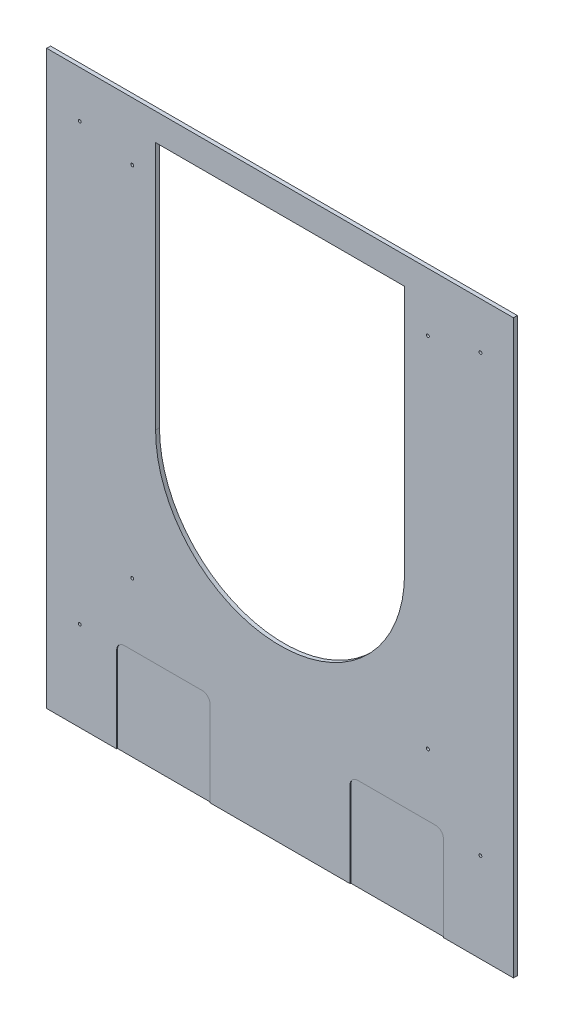
ISO-10303-21;
HEADER;
FILE_DESCRIPTION(('STEP AP214'),'2;1');
FILE_NAME('part.step','',(''),(''),'','','');
FILE_SCHEMA(('AUTOMOTIVE_DESIGN { 1 0 10303 214 1 1 1 1 }'));
ENDSEC;
DATA;
#1=APPLICATION_CONTEXT('core data for automotive mechanical design processes');
#2=APPLICATION_PROTOCOL_DEFINITION('international standard','automotive_design',2000,#1);
#3=PRODUCT_CONTEXT('',#1,'mechanical');
#4=PRODUCT('Part','Part','',(#3));
#5=PRODUCT_RELATED_PRODUCT_CATEGORY('part','',(#4));
#6=PRODUCT_DEFINITION_FORMATION('','',#4);
#7=PRODUCT_DEFINITION_CONTEXT('part definition',#1,'design');
#8=PRODUCT_DEFINITION('design','',#6,#7);
#9=PRODUCT_DEFINITION_SHAPE('','',#8);
#10=(LENGTH_UNIT() NAMED_UNIT(*) SI_UNIT(.MILLI.,.METRE.));
#11=(NAMED_UNIT(*) PLANE_ANGLE_UNIT() SI_UNIT($,.RADIAN.));
#12=(NAMED_UNIT(*) SI_UNIT($,.STERADIAN.) SOLID_ANGLE_UNIT());
#13=UNCERTAINTY_MEASURE_WITH_UNIT(LENGTH_MEASURE(1.E-05),#10,'distance_accuracy_value','');
#14=(GEOMETRIC_REPRESENTATION_CONTEXT(3) GLOBAL_UNCERTAINTY_ASSIGNED_CONTEXT((#13)) GLOBAL_UNIT_ASSIGNED_CONTEXT((#10,
#11,#12)) REPRESENTATION_CONTEXT('',''));
#15=CARTESIAN_POINT('',(0.,0.,0.));
#16=DIRECTION('',(0.,0.,1.));
#17=DIRECTION('',(1.,0.,0.));
#18=AXIS2_PLACEMENT_3D('',#15,#16,#17);
#19=CARTESIAN_POINT('',(-266.7,-327.025,6.35));
#20=DIRECTION('',(-1.,0.,0.));
#21=DIRECTION('',(0.,0.,1.));
#22=AXIS2_PLACEMENT_3D('',#19,#20,#21);
#23=PLANE('',#22);
#24=DIRECTION('',(0.,1.,0.));
#25=VECTOR('',#24,1.);
#26=CARTESIAN_POINT('',(-266.7,0.,5.08));
#27=LINE('',#26,#25);
#28=CARTESIAN_POINT('',(-266.7,-327.025,5.08));
#29=VERTEX_POINT('',#28);
#30=CARTESIAN_POINT('',(-266.7,-466.725,5.08));
#31=VERTEX_POINT('',#30);
#32=EDGE_CURVE('E128',#29,#31,#27,.F.);
#33=ORIENTED_EDGE('',*,*,#32,.F.);
#34=DIRECTION('',(0.,0.,1.));
#35=VECTOR('',#34,1.);
#36=CARTESIAN_POINT('',(-266.7,-327.025,6.35));
#37=LINE('',#36,#35);
#38=CARTESIAN_POINT('',(-266.7,-327.025,6.35));
#39=VERTEX_POINT('',#38);
#40=EDGE_CURVE('E178',#29,#39,#37,.T.);
#41=ORIENTED_EDGE('',*,*,#40,.T.);
#42=DIRECTION('',(0.,1.,0.));
#43=VECTOR('',#42,1.);
#44=CARTESIAN_POINT('',(-266.7,0.,6.35));
#45=LINE('',#44,#43);
#46=CARTESIAN_POINT('',(-266.7,-466.725,6.35));
#47=VERTEX_POINT('',#46);
#48=EDGE_CURVE('E264',#47,#39,#45,.T.);
#49=ORIENTED_EDGE('',*,*,#48,.F.);
#50=DIRECTION('',(0.,0.,1.));
#51=VECTOR('',#50,1.);
#52=CARTESIAN_POINT('',(-266.7,-466.725,6.35));
#53=LINE('',#52,#51);
#54=EDGE_CURVE('E181',#31,#47,#53,.T.);
#55=ORIENTED_EDGE('',*,*,#54,.F.);
#56=EDGE_LOOP('',(#33,#41,#49,#55));
#57=FACE_BOUND('',#56,.T.);
#58=ADVANCED_FACE('F17',(#57),#23,.F.);
#59=CARTESIAN_POINT('',(-254.,-327.025,6.35));
#60=DIRECTION('',(0.,0.,1.));
#61=DIRECTION('',(1.,0.,0.));
#62=AXIS2_PLACEMENT_3D('',#59,#60,#61);
#63=CYLINDRICAL_SURFACE('',#62,12.7);
#64=CARTESIAN_POINT('',(-254.,-327.025,5.08));
#65=DIRECTION('',(0.,0.,1.));
#66=DIRECTION('',(1.,0.,0.));
#67=AXIS2_PLACEMENT_3D('',#64,#65,#66);
#68=CIRCLE('',#67,12.7);
#69=CARTESIAN_POINT('',(-254.,-314.325,5.08));
#70=VERTEX_POINT('',#69);
#71=EDGE_CURVE('E126',#70,#29,#68,.T.);
#72=ORIENTED_EDGE('',*,*,#71,.F.);
#73=DIRECTION('',(0.,0.,1.));
#74=VECTOR('',#73,1.);
#75=CARTESIAN_POINT('',(-254.,-314.325,6.35));
#76=LINE('',#75,#74);
#77=CARTESIAN_POINT('',(-254.,-314.325,6.35));
#78=VERTEX_POINT('',#77);
#79=EDGE_CURVE('E113',#70,#78,#76,.T.);
#80=ORIENTED_EDGE('',*,*,#79,.T.);
#81=CARTESIAN_POINT('',(-254.,-327.025,6.35));
#82=DIRECTION('',(0.,0.,1.));
#83=DIRECTION('',(1.,0.,0.));
#84=AXIS2_PLACEMENT_3D('',#81,#82,#83);
#85=CIRCLE('',#84,12.7);
#86=EDGE_CURVE('E262',#39,#78,#85,.F.);
#87=ORIENTED_EDGE('',*,*,#86,.F.);
#88=ORIENTED_EDGE('',*,*,#40,.F.);
#89=EDGE_LOOP('',(#72,#80,#87,#88));
#90=FACE_BOUND('',#89,.T.);
#91=ADVANCED_FACE('F540',(#90),#63,.F.);
#92=CARTESIAN_POINT('',(-127.,-314.325,6.35));
#93=DIRECTION('',(0.,1.,0.));
#94=DIRECTION('',(0.,0.,1.));
#95=AXIS2_PLACEMENT_3D('',#92,#93,#94);
#96=PLANE('',#95);
#97=DIRECTION('',(1.,0.,0.));
#98=VECTOR('',#97,1.);
#99=CARTESIAN_POINT('',(0.,-314.325,5.08));
#100=LINE('',#99,#98);
#101=CARTESIAN_POINT('',(-127.,-314.325,5.08));
#102=VERTEX_POINT('',#101);
#103=EDGE_CURVE('E120',#102,#70,#100,.F.);
#104=ORIENTED_EDGE('',*,*,#103,.F.);
#105=DIRECTION('',(0.,0.,1.));
#106=VECTOR('',#105,1.);
#107=CARTESIAN_POINT('',(-127.,-314.325,6.35));
#108=LINE('',#107,#106);
#109=CARTESIAN_POINT('',(-127.,-314.325,6.35));
#110=VERTEX_POINT('',#109);
#111=EDGE_CURVE('E105',#102,#110,#108,.T.);
#112=ORIENTED_EDGE('',*,*,#111,.T.);
#113=DIRECTION('',(1.,0.,0.));
#114=VECTOR('',#113,1.);
#115=CARTESIAN_POINT('',(0.,-314.325,6.35));
#116=LINE('',#115,#114);
#117=EDGE_CURVE('E261',#78,#110,#116,.T.);
#118=ORIENTED_EDGE('',*,*,#117,.F.);
#119=ORIENTED_EDGE('',*,*,#79,.F.);
#120=EDGE_LOOP('',(#104,#112,#118,#119));
#121=FACE_BOUND('',#120,.T.);
#122=ADVANCED_FACE('F124',(#121),#96,.F.);
#123=CARTESIAN_POINT('',(-127.,-327.025,6.35));
#124=DIRECTION('',(0.,0.,1.));
#125=DIRECTION('',(1.,0.,0.));
#126=AXIS2_PLACEMENT_3D('',#123,#124,#125);
#127=CYLINDRICAL_SURFACE('',#126,12.7);
#128=CARTESIAN_POINT('',(-127.,-327.025,5.08));
#129=DIRECTION('',(0.,0.,1.));
#130=DIRECTION('',(1.,0.,0.));
#131=AXIS2_PLACEMENT_3D('',#128,#129,#130);
#132=CIRCLE('',#131,12.7);
#133=CARTESIAN_POINT('',(-114.3,-327.025,5.08));
#134=VERTEX_POINT('',#133);
#135=EDGE_CURVE('E20',#134,#102,#132,.T.);
#136=ORIENTED_EDGE('',*,*,#135,.F.);
#137=DIRECTION('',(0.,0.,-1.));
#138=VECTOR('',#137,1.);
#139=CARTESIAN_POINT('',(-114.3,-327.025,6.35));
#140=LINE('',#139,#138);
#141=CARTESIAN_POINT('',(-114.3,-327.025,6.35));
#142=VERTEX_POINT('',#141);
#143=EDGE_CURVE('E98',#134,#142,#140,.F.);
#144=ORIENTED_EDGE('',*,*,#143,.T.);
#145=CARTESIAN_POINT('',(-127.,-327.025,6.35));
#146=DIRECTION('',(0.,0.,1.));
#147=DIRECTION('',(1.,0.,0.));
#148=AXIS2_PLACEMENT_3D('',#145,#146,#147);
#149=CIRCLE('',#148,12.7);
#150=EDGE_CURVE('E108',#110,#142,#149,.F.);
#151=ORIENTED_EDGE('',*,*,#150,.F.);
#152=ORIENTED_EDGE('',*,*,#111,.F.);
#153=EDGE_LOOP('',(#136,#144,#151,#152));
#154=FACE_BOUND('',#153,.T.);
#155=ADVANCED_FACE('F107',(#154),#127,.F.);
#156=CARTESIAN_POINT('',(-114.3,-466.725,6.35));
#157=DIRECTION('',(1.,0.,0.));
#158=DIRECTION('',(0.,0.,-1.));
#159=AXIS2_PLACEMENT_3D('',#156,#157,#158);
#160=PLANE('',#159);
#161=DIRECTION('',(0.,1.,0.));
#162=VECTOR('',#161,1.);
#163=CARTESIAN_POINT('',(-114.3,0.,5.08));
#164=LINE('',#163,#162);
#165=CARTESIAN_POINT('',(-114.3,-466.725,5.08));
#166=VERTEX_POINT('',#165);
#167=EDGE_CURVE('E123',#166,#134,#164,.T.);
#168=ORIENTED_EDGE('',*,*,#167,.F.);
#169=DIRECTION('',(0.,0.,-1.));
#170=VECTOR('',#169,1.);
#171=CARTESIAN_POINT('',(-114.3,-466.725,6.35));
#172=LINE('',#171,#170);
#173=CARTESIAN_POINT('',(-114.3,-466.725,6.35));
#174=VERTEX_POINT('',#173);
#175=EDGE_CURVE('E112',#174,#166,#172,.T.);
#176=ORIENTED_EDGE('',*,*,#175,.F.);
#177=DIRECTION('',(0.,1.,0.));
#178=VECTOR('',#177,1.);
#179=CARTESIAN_POINT('',(-114.3,0.,6.35));
#180=LINE('',#179,#178);
#181=EDGE_CURVE('E260',#142,#174,#180,.F.);
#182=ORIENTED_EDGE('',*,*,#181,.F.);
#183=ORIENTED_EDGE('',*,*,#143,.F.);
#184=EDGE_LOOP('',(#168,#176,#182,#183));
#185=FACE_BOUND('',#184,.T.);
#186=ADVANCED_FACE('F430',(#185),#160,.F.);
#187=CARTESIAN_POINT('',(114.3,-327.025,6.35));
#188=DIRECTION('',(-1.,0.,0.));
#189=DIRECTION('',(0.,0.,1.));
#190=AXIS2_PLACEMENT_3D('',#187,#188,#189);
#191=PLANE('',#190);
#192=DIRECTION('',(0.,1.,0.));
#193=VECTOR('',#192,1.);
#194=CARTESIAN_POINT('',(114.3,0.,5.08));
#195=LINE('',#194,#193);
#196=CARTESIAN_POINT('',(114.3,-327.025,5.08));
#197=VERTEX_POINT('',#196);
#198=CARTESIAN_POINT('',(114.3,-466.725,5.08));
#199=VERTEX_POINT('',#198);
#200=EDGE_CURVE('E268',#197,#199,#195,.F.);
#201=ORIENTED_EDGE('',*,*,#200,.F.);
#202=DIRECTION('',(0.,0.,1.));
#203=VECTOR('',#202,1.);
#204=CARTESIAN_POINT('',(114.3,-327.025,6.35));
#205=LINE('',#204,#203);
#206=CARTESIAN_POINT('',(114.3,-327.025,6.35));
#207=VERTEX_POINT('',#206);
#208=EDGE_CURVE('E157',#197,#207,#205,.T.);
#209=ORIENTED_EDGE('',*,*,#208,.T.);
#210=DIRECTION('',(0.,1.,0.));
#211=VECTOR('',#210,1.);
#212=CARTESIAN_POINT('',(114.3,0.,6.35));
#213=LINE('',#212,#211);
#214=CARTESIAN_POINT('',(114.3,-466.725,6.35));
#215=VERTEX_POINT('',#214);
#216=EDGE_CURVE('E258',#215,#207,#213,.T.);
#217=ORIENTED_EDGE('',*,*,#216,.F.);
#218=DIRECTION('',(0.,0.,1.));
#219=VECTOR('',#218,1.);
#220=CARTESIAN_POINT('',(114.3,-466.725,6.35));
#221=LINE('',#220,#219);
#222=EDGE_CURVE('E160',#199,#215,#221,.T.);
#223=ORIENTED_EDGE('',*,*,#222,.F.);
#224=EDGE_LOOP('',(#201,#209,#217,#223));
#225=FACE_BOUND('',#224,.T.);
#226=ADVANCED_FACE('F432',(#225),#191,.F.);
#227=CARTESIAN_POINT('',(127.,-327.025,6.35));
#228=DIRECTION('',(0.,0.,1.));
#229=DIRECTION('',(1.,0.,0.));
#230=AXIS2_PLACEMENT_3D('',#227,#228,#229);
#231=CYLINDRICAL_SURFACE('',#230,12.7);
#232=CARTESIAN_POINT('',(127.,-327.025,5.08));
#233=DIRECTION('',(0.,0.,1.));
#234=DIRECTION('',(1.,0.,0.));
#235=AXIS2_PLACEMENT_3D('',#232,#233,#234);
#236=CIRCLE('',#235,12.7);
#237=CARTESIAN_POINT('',(127.,-314.325,5.08));
#238=VERTEX_POINT('',#237);
#239=EDGE_CURVE('E265',#238,#197,#236,.T.);
#240=ORIENTED_EDGE('',*,*,#239,.F.);
#241=DIRECTION('',(0.,0.,1.));
#242=VECTOR('',#241,1.);
#243=CARTESIAN_POINT('',(127.,-314.325,6.35));
#244=LINE('',#243,#242);
#245=CARTESIAN_POINT('',(127.,-314.325,6.35));
#246=VERTEX_POINT('',#245);
#247=EDGE_CURVE('E154',#238,#246,#244,.T.);
#248=ORIENTED_EDGE('',*,*,#247,.T.);
#249=CARTESIAN_POINT('',(127.,-327.025,6.35));
#250=DIRECTION('',(0.,0.,1.));
#251=DIRECTION('',(1.,0.,0.));
#252=AXIS2_PLACEMENT_3D('',#249,#250,#251);
#253=CIRCLE('',#252,12.7);
#254=EDGE_CURVE('E256',#207,#246,#253,.F.);
#255=ORIENTED_EDGE('',*,*,#254,.F.);
#256=ORIENTED_EDGE('',*,*,#208,.F.);
#257=EDGE_LOOP('',(#240,#248,#255,#256));
#258=FACE_BOUND('',#257,.T.);
#259=ADVANCED_FACE('F439',(#258),#231,.F.);
#260=CARTESIAN_POINT('',(254.,-314.325,6.35));
#261=DIRECTION('',(0.,1.,0.));
#262=DIRECTION('',(0.,0.,1.));
#263=AXIS2_PLACEMENT_3D('',#260,#261,#262);
#264=PLANE('',#263);
#265=DIRECTION('',(1.,0.,0.));
#266=VECTOR('',#265,1.);
#267=CARTESIAN_POINT('',(0.,-314.325,5.08));
#268=LINE('',#267,#266);
#269=CARTESIAN_POINT('',(254.,-314.325,5.08));
#270=VERTEX_POINT('',#269);
#271=EDGE_CURVE('E269',#270,#238,#268,.F.);
#272=ORIENTED_EDGE('',*,*,#271,.F.);
#273=DIRECTION('',(0.,0.,1.));
#274=VECTOR('',#273,1.);
#275=CARTESIAN_POINT('',(254.,-314.325,6.35));
#276=LINE('',#275,#274);
#277=CARTESIAN_POINT('',(254.,-314.325,6.35));
#278=VERTEX_POINT('',#277);
#279=EDGE_CURVE('E142',#270,#278,#276,.T.);
#280=ORIENTED_EDGE('',*,*,#279,.T.);
#281=DIRECTION('',(1.,0.,0.));
#282=VECTOR('',#281,1.);
#283=CARTESIAN_POINT('',(0.,-314.325,6.35));
#284=LINE('',#283,#282);
#285=EDGE_CURVE('E255',#246,#278,#284,.T.);
#286=ORIENTED_EDGE('',*,*,#285,.F.);
#287=ORIENTED_EDGE('',*,*,#247,.F.);
#288=EDGE_LOOP('',(#272,#280,#286,#287));
#289=FACE_BOUND('',#288,.T.);
#290=ADVANCED_FACE('F520',(#289),#264,.F.);
#291=CARTESIAN_POINT('',(254.,-327.025,6.35));
#292=DIRECTION('',(0.,0.,1.));
#293=DIRECTION('',(1.,0.,0.));
#294=AXIS2_PLACEMENT_3D('',#291,#292,#293);
#295=CYLINDRICAL_SURFACE('',#294,12.7);
#296=CARTESIAN_POINT('',(254.,-327.025,5.08));
#297=DIRECTION('',(0.,0.,1.));
#298=DIRECTION('',(1.,0.,0.));
#299=AXIS2_PLACEMENT_3D('',#296,#297,#298);
#300=CIRCLE('',#299,12.7);
#301=CARTESIAN_POINT('',(266.7,-327.025,5.08));
#302=VERTEX_POINT('',#301);
#303=EDGE_CURVE('E270',#302,#270,#300,.T.);
#304=ORIENTED_EDGE('',*,*,#303,.F.);
#305=DIRECTION('',(0.,0.,-1.));
#306=VECTOR('',#305,1.);
#307=CARTESIAN_POINT('',(266.7,-327.025,6.35));
#308=LINE('',#307,#306);
#309=CARTESIAN_POINT('',(266.7,-327.025,6.35));
#310=VERTEX_POINT('',#309);
#311=EDGE_CURVE('E134',#302,#310,#308,.F.);
#312=ORIENTED_EDGE('',*,*,#311,.T.);
#313=CARTESIAN_POINT('',(254.,-327.025,6.35));
#314=DIRECTION('',(0.,0.,1.));
#315=DIRECTION('',(1.,0.,0.));
#316=AXIS2_PLACEMENT_3D('',#313,#314,#315);
#317=CIRCLE('',#316,12.7);
#318=EDGE_CURVE('E253',#278,#310,#317,.F.);
#319=ORIENTED_EDGE('',*,*,#318,.F.);
#320=ORIENTED_EDGE('',*,*,#279,.F.);
#321=EDGE_LOOP('',(#304,#312,#319,#320));
#322=FACE_BOUND('',#321,.T.);
#323=ADVANCED_FACE('F516',(#322),#295,.F.);
#324=CARTESIAN_POINT('',(266.7,-466.725,6.35));
#325=DIRECTION('',(1.,0.,0.));
#326=DIRECTION('',(0.,0.,-1.));
#327=AXIS2_PLACEMENT_3D('',#324,#325,#326);
#328=PLANE('',#327);
#329=DIRECTION('',(0.,1.,0.));
#330=VECTOR('',#329,1.);
#331=CARTESIAN_POINT('',(266.7,0.,5.08));
#332=LINE('',#331,#330);
#333=CARTESIAN_POINT('',(266.7,-466.725,5.08));
#334=VERTEX_POINT('',#333);
#335=EDGE_CURVE('E272',#334,#302,#332,.T.);
#336=ORIENTED_EDGE('',*,*,#335,.F.);
#337=DIRECTION('',(0.,0.,-1.));
#338=VECTOR('',#337,1.);
#339=CARTESIAN_POINT('',(266.7,-466.725,6.35));
#340=LINE('',#339,#338);
#341=CARTESIAN_POINT('',(266.7,-466.725,6.35));
#342=VERTEX_POINT('',#341);
#343=EDGE_CURVE('E139',#342,#334,#340,.T.);
#344=ORIENTED_EDGE('',*,*,#343,.F.);
#345=DIRECTION('',(0.,1.,0.));
#346=VECTOR('',#345,1.);
#347=CARTESIAN_POINT('',(266.7,0.,6.35));
#348=LINE('',#347,#346);
#349=EDGE_CURVE('E169',#310,#342,#348,.F.);
#350=ORIENTED_EDGE('',*,*,#349,.F.);
#351=ORIENTED_EDGE('',*,*,#311,.F.);
#352=EDGE_LOOP('',(#336,#344,#350,#351));
#353=FACE_BOUND('',#352,.T.);
#354=ADVANCED_FACE('F513',(#353),#328,.F.);
#355=CARTESIAN_POINT('',(0.,0.,5.08));
#356=DIRECTION('',(0.,0.,1.));
#357=DIRECTION('',(1.,0.,0.));
#358=AXIS2_PLACEMENT_3D('',#355,#356,#357);
#359=PLANE('',#358);
#360=ORIENTED_EDGE('',*,*,#32,.T.);
#361=DIRECTION('',(1.,0.,0.));
#362=VECTOR('',#361,1.);
#363=CARTESIAN_POINT('',(-381.,-466.725,5.08));
#364=LINE('',#363,#362);
#365=EDGE_CURVE('E168',#166,#31,#364,.F.);
#366=ORIENTED_EDGE('',*,*,#365,.F.);
#367=ORIENTED_EDGE('',*,*,#167,.T.);
#368=ORIENTED_EDGE('',*,*,#135,.T.);
#369=ORIENTED_EDGE('',*,*,#103,.T.);
#370=ORIENTED_EDGE('',*,*,#71,.T.);
#371=EDGE_LOOP('',(#360,#366,#367,#368,#369,#370));
#372=FACE_BOUND('',#371,.T.);
#373=ADVANCED_FACE('F118',(#372),#359,.T.);
#374=CARTESIAN_POINT('',(0.,0.,5.08));
#375=DIRECTION('',(0.,0.,1.));
#376=DIRECTION('',(1.,0.,0.));
#377=AXIS2_PLACEMENT_3D('',#374,#375,#376);
#378=PLANE('',#377);
#379=ORIENTED_EDGE('',*,*,#200,.T.);
#380=DIRECTION('',(1.,0.,0.));
#381=VECTOR('',#380,1.);
#382=CARTESIAN_POINT('',(-381.,-466.725,5.08));
#383=LINE('',#382,#381);
#384=EDGE_CURVE('E148',#334,#199,#383,.F.);
#385=ORIENTED_EDGE('',*,*,#384,.F.);
#386=ORIENTED_EDGE('',*,*,#335,.T.);
#387=ORIENTED_EDGE('',*,*,#303,.T.);
#388=ORIENTED_EDGE('',*,*,#271,.T.);
#389=ORIENTED_EDGE('',*,*,#239,.T.);
#390=EDGE_LOOP('',(#379,#385,#386,#387,#388,#389));
#391=FACE_BOUND('',#390,.T.);
#392=ADVANCED_FACE('F507',(#391),#378,.T.);
#393=CARTESIAN_POINT('',(0.,0.,6.35));
#394=DIRECTION('',(0.,0.,1.));
#395=DIRECTION('',(1.,0.,0.));
#396=AXIS2_PLACEMENT_3D('',#393,#394,#395);
#397=PLANE('',#396);
#398=CARTESIAN_POINT('',(-327.025,390.525,6.35));
#399=DIRECTION('',(0.,0.,1.));
#400=DIRECTION('',(1.,0.,0.));
#401=AXIS2_PLACEMENT_3D('',#398,#399,#400);
#402=CIRCLE('',#401,2.413);
#403=CARTESIAN_POINT('',(-324.612,390.525,6.35));
#404=VERTEX_POINT('',#403);
#405=EDGE_CURVE('E224',#404,#404,#402,.F.);
#406=ORIENTED_EDGE('',*,*,#405,.T.);
#407=EDGE_LOOP('',(#406));
#408=FACE_BOUND('',#407,.T.);
#409=CARTESIAN_POINT('',(-327.025,-320.675,6.35));
#410=DIRECTION('',(0.,0.,1.));
#411=DIRECTION('',(1.,0.,0.));
#412=AXIS2_PLACEMENT_3D('',#409,#410,#411);
#413=CIRCLE('',#412,2.413);
#414=CARTESIAN_POINT('',(-324.612,-320.675,6.35));
#415=VERTEX_POINT('',#414);
#416=EDGE_CURVE('E228',#415,#415,#413,.F.);
#417=ORIENTED_EDGE('',*,*,#416,.T.);
#418=EDGE_LOOP('',(#417));
#419=FACE_BOUND('',#418,.T.);
#420=CARTESIAN_POINT('',(327.025,-320.675,6.35));
#421=DIRECTION('',(0.,0.,1.));
#422=DIRECTION('',(1.,0.,0.));
#423=AXIS2_PLACEMENT_3D('',#420,#421,#422);
#424=CIRCLE('',#423,2.413);
#425=CARTESIAN_POINT('',(329.438,-320.675,6.35));
#426=VERTEX_POINT('',#425);
#427=EDGE_CURVE('E231',#426,#426,#424,.F.);
#428=ORIENTED_EDGE('',*,*,#427,.T.);
#429=EDGE_LOOP('',(#428));
#430=FACE_BOUND('',#429,.T.);
#431=CARTESIAN_POINT('',(327.025,390.525,6.35));
#432=DIRECTION('',(0.,0.,1.));
#433=DIRECTION('',(1.,0.,0.));
#434=AXIS2_PLACEMENT_3D('',#431,#432,#433);
#435=CIRCLE('',#434,2.413);
#436=CARTESIAN_POINT('',(329.438,390.525,6.35));
#437=VERTEX_POINT('',#436);
#438=EDGE_CURVE('E234',#437,#437,#435,.F.);
#439=ORIENTED_EDGE('',*,*,#438,.T.);
#440=EDGE_LOOP('',(#439));
#441=FACE_BOUND('',#440,.T.);
#442=CARTESIAN_POINT('',(-241.3,371.475,6.35));
#443=DIRECTION('',(0.,0.,1.));
#444=DIRECTION('',(1.,0.,0.));
#445=AXIS2_PLACEMENT_3D('',#442,#443,#444);
#446=CIRCLE('',#445,2.413);
#447=CARTESIAN_POINT('',(-238.887,371.475,6.35));
#448=VERTEX_POINT('',#447);
#449=EDGE_CURVE('E237',#448,#448,#446,.F.);
#450=ORIENTED_EDGE('',*,*,#449,.T.);
#451=EDGE_LOOP('',(#450));
#452=FACE_BOUND('',#451,.T.);
#453=CARTESIAN_POINT('',(-241.3,-212.725,6.35));
#454=DIRECTION('',(0.,0.,1.));
#455=DIRECTION('',(1.,0.,0.));
#456=AXIS2_PLACEMENT_3D('',#453,#454,#455);
#457=CIRCLE('',#456,2.413);
#458=CARTESIAN_POINT('',(-238.887,-212.725,6.35));
#459=VERTEX_POINT('',#458);
#460=EDGE_CURVE('E240',#459,#459,#457,.F.);
#461=ORIENTED_EDGE('',*,*,#460,.T.);
#462=EDGE_LOOP('',(#461));
#463=FACE_BOUND('',#462,.T.);
#464=CARTESIAN_POINT('',(241.3,-212.725,6.35));
#465=DIRECTION('',(0.,0.,1.));
#466=DIRECTION('',(1.,0.,0.));
#467=AXIS2_PLACEMENT_3D('',#464,#465,#466);
#468=CIRCLE('',#467,2.413);
#469=CARTESIAN_POINT('',(243.713,-212.725,6.35));
#470=VERTEX_POINT('',#469);
#471=EDGE_CURVE('E243',#470,#470,#468,.F.);
#472=ORIENTED_EDGE('',*,*,#471,.T.);
#473=EDGE_LOOP('',(#472));
#474=FACE_BOUND('',#473,.T.);
#475=CARTESIAN_POINT('',(241.3,371.475,6.35));
#476=DIRECTION('',(0.,0.,1.));
#477=DIRECTION('',(1.,0.,0.));
#478=AXIS2_PLACEMENT_3D('',#475,#476,#477);
#479=CIRCLE('',#478,2.413);
#480=CARTESIAN_POINT('',(243.713,371.475,6.35));
#481=VERTEX_POINT('',#480);
#482=EDGE_CURVE('E246',#481,#481,#479,.F.);
#483=ORIENTED_EDGE('',*,*,#482,.T.);
#484=EDGE_LOOP('',(#483));
#485=FACE_BOUND('',#484,.T.);
#486=DIRECTION('',(0.,1.,0.));
#487=VECTOR('',#486,1.);
#488=CARTESIAN_POINT('',(-203.2,422.275,6.35));
#489=LINE('',#488,#487);
#490=CARTESIAN_POINT('',(-203.2,15.875,6.35));
#491=VERTEX_POINT('',#490);
#492=CARTESIAN_POINT('',(-203.2,422.275,6.35));
#493=VERTEX_POINT('',#492);
#494=EDGE_CURVE('E296',#491,#493,#489,.T.);
#495=ORIENTED_EDGE('',*,*,#494,.T.);
#496=DIRECTION('',(1.,0.,0.));
#497=VECTOR('',#496,1.);
#498=CARTESIAN_POINT('',(203.2,422.275,6.35));
#499=LINE('',#498,#497);
#500=CARTESIAN_POINT('',(203.2,422.275,6.35));
#501=VERTEX_POINT('',#500);
#502=EDGE_CURVE('E301',#493,#501,#499,.T.);
#503=ORIENTED_EDGE('',*,*,#502,.T.);
#504=DIRECTION('',(0.,1.,0.));
#505=VECTOR('',#504,1.);
#506=CARTESIAN_POINT('',(203.2,15.875,6.35));
#507=LINE('',#506,#505);
#508=CARTESIAN_POINT('',(203.2,15.875,6.35));
#509=VERTEX_POINT('',#508);
#510=EDGE_CURVE('E291',#501,#509,#507,.F.);
#511=ORIENTED_EDGE('',*,*,#510,.T.);
#512=CARTESIAN_POINT('',(0.,15.875,6.35));
#513=DIRECTION('',(0.,0.,1.));
#514=DIRECTION('',(1.,0.,0.));
#515=AXIS2_PLACEMENT_3D('',#512,#513,#514);
#516=CIRCLE('',#515,203.2);
#517=EDGE_CURVE('E250',#509,#491,#516,.F.);
#518=ORIENTED_EDGE('',*,*,#517,.T.);
#519=EDGE_LOOP('',(#495,#503,#511,#518));
#520=FACE_BOUND('',#519,.T.);
#521=ORIENTED_EDGE('',*,*,#318,.T.);
#522=ORIENTED_EDGE('',*,*,#349,.T.);
#523=DIRECTION('',(1.,0.,0.));
#524=VECTOR('',#523,1.);
#525=CARTESIAN_POINT('',(-381.,-466.725,6.35));
#526=LINE('',#525,#524);
#527=CARTESIAN_POINT('',(381.,-466.725,6.35));
#528=VERTEX_POINT('',#527);
#529=EDGE_CURVE('E145',#528,#342,#526,.F.);
#530=ORIENTED_EDGE('',*,*,#529,.F.);
#531=DIRECTION('',(0.,1.,0.));
#532=VECTOR('',#531,1.);
#533=CARTESIAN_POINT('',(381.,-466.725,6.35));
#534=LINE('',#533,#532);
#535=CARTESIAN_POINT('',(381.,466.725,6.35));
#536=VERTEX_POINT('',#535);
#537=EDGE_CURVE('E192',#536,#528,#534,.F.);
#538=ORIENTED_EDGE('',*,*,#537,.F.);
#539=DIRECTION('',(1.,0.,0.));
#540=VECTOR('',#539,1.);
#541=CARTESIAN_POINT('',(381.,466.725,6.35));
#542=LINE('',#541,#540);
#543=CARTESIAN_POINT('',(-381.,466.725,6.35));
#544=VERTEX_POINT('',#543);
#545=EDGE_CURVE('E326',#544,#536,#542,.T.);
#546=ORIENTED_EDGE('',*,*,#545,.F.);
#547=DIRECTION('',(0.,1.,0.));
#548=VECTOR('',#547,1.);
#549=CARTESIAN_POINT('',(-381.,466.725,6.35));
#550=LINE('',#549,#548);
#551=CARTESIAN_POINT('',(-381.,-466.725,6.35));
#552=VERTEX_POINT('',#551);
#553=EDGE_CURVE('E335',#552,#544,#550,.T.);
#554=ORIENTED_EDGE('',*,*,#553,.F.);
#555=DIRECTION('',(1.,0.,0.));
#556=VECTOR('',#555,1.);
#557=CARTESIAN_POINT('',(-381.,-466.725,6.35));
#558=LINE('',#557,#556);
#559=EDGE_CURVE('E149',#47,#552,#558,.F.);
#560=ORIENTED_EDGE('',*,*,#559,.F.);
#561=ORIENTED_EDGE('',*,*,#48,.T.);
#562=ORIENTED_EDGE('',*,*,#86,.T.);
#563=ORIENTED_EDGE('',*,*,#117,.T.);
#564=ORIENTED_EDGE('',*,*,#150,.T.);
#565=ORIENTED_EDGE('',*,*,#181,.T.);
#566=DIRECTION('',(1.,0.,0.));
#567=VECTOR('',#566,1.);
#568=CARTESIAN_POINT('',(-381.,-466.725,6.35));
#569=LINE('',#568,#567);
#570=EDGE_CURVE('E165',#215,#174,#569,.F.);
#571=ORIENTED_EDGE('',*,*,#570,.F.);
#572=ORIENTED_EDGE('',*,*,#216,.T.);
#573=ORIENTED_EDGE('',*,*,#254,.T.);
#574=ORIENTED_EDGE('',*,*,#285,.T.);
#575=EDGE_LOOP('',(#521,#522,#530,#538,#546,#554,#560,#561,#562,#563,#564,#565,#571,#572,#573,#574));
#576=FACE_BOUND('',#575,.T.);
#577=ADVANCED_FACE('F398',(#408,#419,#430,#441,#452,#463,#474,#485,#520,#576),#397,.T.);
#578=CARTESIAN_POINT('',(-381.,-466.725,0.));
#579=DIRECTION('',(0.,-1.,0.));
#580=DIRECTION('',(0.,0.,-1.));
#581=AXIS2_PLACEMENT_3D('',#578,#579,#580);
#582=PLANE('',#581);
#583=ORIENTED_EDGE('',*,*,#343,.T.);
#584=ORIENTED_EDGE('',*,*,#384,.T.);
#585=ORIENTED_EDGE('',*,*,#222,.T.);
#586=ORIENTED_EDGE('',*,*,#570,.T.);
#587=ORIENTED_EDGE('',*,*,#175,.T.);
#588=ORIENTED_EDGE('',*,*,#365,.T.);
#589=ORIENTED_EDGE('',*,*,#54,.T.);
#590=ORIENTED_EDGE('',*,*,#559,.T.);
#591=DIRECTION('',(0.,0.,1.));
#592=VECTOR('',#591,1.);
#593=CARTESIAN_POINT('',(-381.,-466.725,0.));
#594=LINE('',#593,#592);
#595=CARTESIAN_POINT('',(-381.,-466.725,0.));
#596=VERTEX_POINT('',#595);
#597=EDGE_CURVE('E332',#596,#552,#594,.T.);
#598=ORIENTED_EDGE('',*,*,#597,.F.);
#599=DIRECTION('',(1.,0.,0.));
#600=VECTOR('',#599,1.);
#601=CARTESIAN_POINT('',(0.,-466.725,0.));
#602=LINE('',#601,#600);
#603=CARTESIAN_POINT('',(381.,-466.725,0.));
#604=VERTEX_POINT('',#603);
#605=EDGE_CURVE('E227',#596,#604,#602,.T.);
#606=ORIENTED_EDGE('',*,*,#605,.T.);
#607=DIRECTION('',(0.,0.,-1.));
#608=VECTOR('',#607,1.);
#609=CARTESIAN_POINT('',(381.,-466.725,0.));
#610=LINE('',#609,#608);
#611=EDGE_CURVE('E323',#528,#604,#610,.T.);
#612=ORIENTED_EDGE('',*,*,#611,.F.);
#613=ORIENTED_EDGE('',*,*,#529,.T.);
#614=EDGE_LOOP('',(#583,#584,#585,#586,#587,#588,#589,#590,#598,#606,#612,#613));
#615=FACE_BOUND('',#614,.T.);
#616=ADVANCED_FACE('F428',(#615),#582,.T.);
#617=CARTESIAN_POINT('',(381.,-466.725,0.));
#618=DIRECTION('',(1.,0.,0.));
#619=DIRECTION('',(0.,0.,-1.));
#620=AXIS2_PLACEMENT_3D('',#617,#618,#619);
#621=PLANE('',#620);
#622=ORIENTED_EDGE('',*,*,#611,.T.);
#623=DIRECTION('',(0.,1.,0.));
#624=VECTOR('',#623,1.);
#625=CARTESIAN_POINT('',(381.,0.,0.));
#626=LINE('',#625,#624);
#627=CARTESIAN_POINT('',(381.,466.725,0.));
#628=VERTEX_POINT('',#627);
#629=EDGE_CURVE('E359',#604,#628,#626,.T.);
#630=ORIENTED_EDGE('',*,*,#629,.T.);
#631=DIRECTION('',(0.,0.,1.));
#632=VECTOR('',#631,1.);
#633=CARTESIAN_POINT('',(381.,466.725,0.));
#634=LINE('',#633,#632);
#635=EDGE_CURVE('E329',#536,#628,#634,.F.);
#636=ORIENTED_EDGE('',*,*,#635,.F.);
#637=ORIENTED_EDGE('',*,*,#537,.T.);
#638=EDGE_LOOP('',(#622,#630,#636,#637));
#639=FACE_BOUND('',#638,.T.);
#640=ADVANCED_FACE('F498',(#639),#621,.T.);
#641=CARTESIAN_POINT('',(381.,466.725,0.));
#642=DIRECTION('',(0.,1.,0.));
#643=DIRECTION('',(0.,0.,1.));
#644=AXIS2_PLACEMENT_3D('',#641,#642,#643);
#645=PLANE('',#644);
#646=ORIENTED_EDGE('',*,*,#635,.T.);
#647=DIRECTION('',(1.,0.,0.));
#648=VECTOR('',#647,1.);
#649=CARTESIAN_POINT('',(0.,466.725,0.));
#650=LINE('',#649,#648);
#651=CARTESIAN_POINT('',(-381.,466.725,0.));
#652=VERTEX_POINT('',#651);
#653=EDGE_CURVE('E362',#628,#652,#650,.F.);
#654=ORIENTED_EDGE('',*,*,#653,.T.);
#655=DIRECTION('',(0.,0.,1.));
#656=VECTOR('',#655,1.);
#657=CARTESIAN_POINT('',(-381.,466.725,0.));
#658=LINE('',#657,#656);
#659=EDGE_CURVE('E304',#544,#652,#658,.F.);
#660=ORIENTED_EDGE('',*,*,#659,.F.);
#661=ORIENTED_EDGE('',*,*,#545,.T.);
#662=EDGE_LOOP('',(#646,#654,#660,#661));
#663=FACE_BOUND('',#662,.T.);
#664=ADVANCED_FACE('F494',(#663),#645,.T.);
#665=CARTESIAN_POINT('',(-381.,466.725,0.));
#666=DIRECTION('',(-1.,0.,0.));
#667=DIRECTION('',(0.,0.,1.));
#668=AXIS2_PLACEMENT_3D('',#665,#666,#667);
#669=PLANE('',#668);
#670=ORIENTED_EDGE('',*,*,#659,.T.);
#671=DIRECTION('',(0.,1.,0.));
#672=VECTOR('',#671,1.);
#673=CARTESIAN_POINT('',(-381.,0.,0.));
#674=LINE('',#673,#672);
#675=EDGE_CURVE('E351',#652,#596,#674,.F.);
#676=ORIENTED_EDGE('',*,*,#675,.T.);
#677=ORIENTED_EDGE('',*,*,#597,.T.);
#678=ORIENTED_EDGE('',*,*,#553,.T.);
#679=EDGE_LOOP('',(#670,#676,#677,#678));
#680=FACE_BOUND('',#679,.T.);
#681=ADVANCED_FACE('F491',(#680),#669,.T.);
#682=CARTESIAN_POINT('',(203.2,422.275,6.35));
#683=DIRECTION('',(0.,1.,0.));
#684=DIRECTION('',(0.,0.,1.));
#685=AXIS2_PLACEMENT_3D('',#682,#683,#684);
#686=PLANE('',#685);
#687=ORIENTED_EDGE('',*,*,#502,.F.);
#688=DIRECTION('',(0.,0.,1.));
#689=VECTOR('',#688,1.);
#690=CARTESIAN_POINT('',(-203.2,422.275,6.35));
#691=LINE('',#690,#689);
#692=CARTESIAN_POINT('',(-203.2,422.275,0.));
#693=VERTEX_POINT('',#692);
#694=EDGE_CURVE('E249',#493,#693,#691,.F.);
#695=ORIENTED_EDGE('',*,*,#694,.T.);
#696=DIRECTION('',(1.,0.,0.));
#697=VECTOR('',#696,1.);
#698=CARTESIAN_POINT('',(0.,422.275,0.));
#699=LINE('',#698,#697);
#700=CARTESIAN_POINT('',(203.2,422.275,0.));
#701=VERTEX_POINT('',#700);
#702=EDGE_CURVE('E348',#693,#701,#699,.T.);
#703=ORIENTED_EDGE('',*,*,#702,.T.);
#704=DIRECTION('',(0.,0.,-1.));
#705=VECTOR('',#704,1.);
#706=CARTESIAN_POINT('',(203.2,422.275,6.35));
#707=LINE('',#706,#705);
#708=EDGE_CURVE('E293',#701,#501,#707,.F.);
#709=ORIENTED_EDGE('',*,*,#708,.T.);
#710=EDGE_LOOP('',(#687,#695,#703,#709));
#711=FACE_BOUND('',#710,.T.);
#712=ADVANCED_FACE('F394',(#711),#686,.F.);
#713=CARTESIAN_POINT('',(203.2,15.875,6.35));
#714=DIRECTION('',(1.,0.,0.));
#715=DIRECTION('',(0.,0.,-1.));
#716=AXIS2_PLACEMENT_3D('',#713,#714,#715);
#717=PLANE('',#716);
#718=ORIENTED_EDGE('',*,*,#510,.F.);
#719=ORIENTED_EDGE('',*,*,#708,.F.);
#720=DIRECTION('',(0.,1.,0.));
#721=VECTOR('',#720,1.);
#722=CARTESIAN_POINT('',(203.2,0.,0.));
#723=LINE('',#722,#721);
#724=CARTESIAN_POINT('',(203.2,15.875,0.));
#725=VERTEX_POINT('',#724);
#726=EDGE_CURVE('E223',#701,#725,#723,.F.);
#727=ORIENTED_EDGE('',*,*,#726,.T.);
#728=DIRECTION('',(0.,0.,1.));
#729=VECTOR('',#728,1.);
#730=CARTESIAN_POINT('',(203.2,15.875,6.35));
#731=LINE('',#730,#729);
#732=EDGE_CURVE('E252',#725,#509,#731,.T.);
#733=ORIENTED_EDGE('',*,*,#732,.T.);
#734=EDGE_LOOP('',(#718,#719,#727,#733));
#735=FACE_BOUND('',#734,.T.);
#736=ADVANCED_FACE('F389',(#735),#717,.F.);
#737=CARTESIAN_POINT('',(0.,15.875,6.35));
#738=DIRECTION('',(0.,0.,1.));
#739=DIRECTION('',(1.,0.,0.));
#740=AXIS2_PLACEMENT_3D('',#737,#738,#739);
#741=CYLINDRICAL_SURFACE('',#740,203.2);
#742=ORIENTED_EDGE('',*,*,#517,.F.);
#743=ORIENTED_EDGE('',*,*,#732,.F.);
#744=CARTESIAN_POINT('',(0.,15.875,0.));
#745=DIRECTION('',(0.,0.,1.));
#746=DIRECTION('',(1.,0.,0.));
#747=AXIS2_PLACEMENT_3D('',#744,#745,#746);
#748=CIRCLE('',#747,203.2);
#749=CARTESIAN_POINT('',(-203.2,15.875,0.));
#750=VERTEX_POINT('',#749);
#751=EDGE_CURVE('E220',#725,#750,#748,.F.);
#752=ORIENTED_EDGE('',*,*,#751,.T.);
#753=DIRECTION('',(0.,0.,1.));
#754=VECTOR('',#753,1.);
#755=CARTESIAN_POINT('',(-203.2,15.875,6.35));
#756=LINE('',#755,#754);
#757=EDGE_CURVE('E35',#750,#491,#756,.T.);
#758=ORIENTED_EDGE('',*,*,#757,.T.);
#759=EDGE_LOOP('',(#742,#743,#752,#758));
#760=FACE_BOUND('',#759,.T.);
#761=ADVANCED_FACE('F386',(#760),#741,.F.);
#762=CARTESIAN_POINT('',(-203.2,422.275,6.35));
#763=DIRECTION('',(-1.,0.,0.));
#764=DIRECTION('',(0.,0.,1.));
#765=AXIS2_PLACEMENT_3D('',#762,#763,#764);
#766=PLANE('',#765);
#767=ORIENTED_EDGE('',*,*,#494,.F.);
#768=ORIENTED_EDGE('',*,*,#757,.F.);
#769=DIRECTION('',(0.,1.,0.));
#770=VECTOR('',#769,1.);
#771=CARTESIAN_POINT('',(-203.2,0.,0.));
#772=LINE('',#771,#770);
#773=EDGE_CURVE('E219',#750,#693,#772,.T.);
#774=ORIENTED_EDGE('',*,*,#773,.T.);
#775=ORIENTED_EDGE('',*,*,#694,.F.);
#776=EDGE_LOOP('',(#767,#768,#774,#775));
#777=FACE_BOUND('',#776,.T.);
#778=ADVANCED_FACE('F375',(#777),#766,.F.);
#779=CARTESIAN_POINT('',(241.3,371.475,6.35));
#780=DIRECTION('',(0.,0.,1.));
#781=DIRECTION('',(1.,0.,0.));
#782=AXIS2_PLACEMENT_3D('',#779,#780,#781);
#783=CYLINDRICAL_SURFACE('',#782,2.413);
#784=ORIENTED_EDGE('',*,*,#482,.F.);
#785=EDGE_LOOP('',(#784));
#786=FACE_BOUND('',#785,.T.);
#787=CARTESIAN_POINT('',(241.3,371.475,0.));
#788=DIRECTION('',(0.,0.,1.));
#789=DIRECTION('',(1.,0.,0.));
#790=AXIS2_PLACEMENT_3D('',#787,#788,#789);
#791=CIRCLE('',#790,2.413);
#792=CARTESIAN_POINT('',(243.713,371.475,0.));
#793=VERTEX_POINT('',#792);
#794=EDGE_CURVE('E216',#793,#793,#791,.F.);
#795=ORIENTED_EDGE('',*,*,#794,.T.);
#796=EDGE_LOOP('',(#795));
#797=FACE_BOUND('',#796,.T.);
#798=ADVANCED_FACE('F478',(#786,#797),#783,.F.);
#799=CARTESIAN_POINT('',(241.3,-212.725,6.35));
#800=DIRECTION('',(0.,0.,1.));
#801=DIRECTION('',(1.,0.,0.));
#802=AXIS2_PLACEMENT_3D('',#799,#800,#801);
#803=CYLINDRICAL_SURFACE('',#802,2.413);
#804=ORIENTED_EDGE('',*,*,#471,.F.);
#805=EDGE_LOOP('',(#804));
#806=FACE_BOUND('',#805,.T.);
#807=CARTESIAN_POINT('',(241.3,-212.725,0.));
#808=DIRECTION('',(0.,0.,1.));
#809=DIRECTION('',(1.,0.,0.));
#810=AXIS2_PLACEMENT_3D('',#807,#808,#809);
#811=CIRCLE('',#810,2.413);
#812=CARTESIAN_POINT('',(243.713,-212.725,0.));
#813=VERTEX_POINT('',#812);
#814=EDGE_CURVE('E213',#813,#813,#811,.F.);
#815=ORIENTED_EDGE('',*,*,#814,.T.);
#816=EDGE_LOOP('',(#815));
#817=FACE_BOUND('',#816,.T.);
#818=ADVANCED_FACE('F474',(#806,#817),#803,.F.);
#819=CARTESIAN_POINT('',(-241.3,-212.725,6.35));
#820=DIRECTION('',(0.,0.,1.));
#821=DIRECTION('',(1.,0.,0.));
#822=AXIS2_PLACEMENT_3D('',#819,#820,#821);
#823=CYLINDRICAL_SURFACE('',#822,2.413);
#824=ORIENTED_EDGE('',*,*,#460,.F.);
#825=EDGE_LOOP('',(#824));
#826=FACE_BOUND('',#825,.T.);
#827=CARTESIAN_POINT('',(-241.3,-212.725,0.));
#828=DIRECTION('',(0.,0.,1.));
#829=DIRECTION('',(1.,0.,0.));
#830=AXIS2_PLACEMENT_3D('',#827,#828,#829);
#831=CIRCLE('',#830,2.413);
#832=CARTESIAN_POINT('',(-238.887,-212.725,0.));
#833=VERTEX_POINT('',#832);
#834=EDGE_CURVE('E210',#833,#833,#831,.F.);
#835=ORIENTED_EDGE('',*,*,#834,.T.);
#836=EDGE_LOOP('',(#835));
#837=FACE_BOUND('',#836,.T.);
#838=ADVANCED_FACE('F470',(#826,#837),#823,.F.);
#839=CARTESIAN_POINT('',(-241.3,371.475,6.35));
#840=DIRECTION('',(0.,0.,1.));
#841=DIRECTION('',(1.,0.,0.));
#842=AXIS2_PLACEMENT_3D('',#839,#840,#841);
#843=CYLINDRICAL_SURFACE('',#842,2.413);
#844=ORIENTED_EDGE('',*,*,#449,.F.);
#845=EDGE_LOOP('',(#844));
#846=FACE_BOUND('',#845,.T.);
#847=CARTESIAN_POINT('',(-241.3,371.475,0.));
#848=DIRECTION('',(0.,0.,1.));
#849=DIRECTION('',(1.,0.,0.));
#850=AXIS2_PLACEMENT_3D('',#847,#848,#849);
#851=CIRCLE('',#850,2.413);
#852=CARTESIAN_POINT('',(-238.887,371.475,0.));
#853=VERTEX_POINT('',#852);
#854=EDGE_CURVE('E207',#853,#853,#851,.F.);
#855=ORIENTED_EDGE('',*,*,#854,.T.);
#856=EDGE_LOOP('',(#855));
#857=FACE_BOUND('',#856,.T.);
#858=ADVANCED_FACE('F466',(#846,#857),#843,.F.);
#859=CARTESIAN_POINT('',(327.025,390.525,6.35));
#860=DIRECTION('',(0.,0.,1.));
#861=DIRECTION('',(1.,0.,0.));
#862=AXIS2_PLACEMENT_3D('',#859,#860,#861);
#863=CYLINDRICAL_SURFACE('',#862,2.413);
#864=ORIENTED_EDGE('',*,*,#438,.F.);
#865=EDGE_LOOP('',(#864));
#866=FACE_BOUND('',#865,.T.);
#867=CARTESIAN_POINT('',(327.025,390.525,0.));
#868=DIRECTION('',(0.,0.,1.));
#869=DIRECTION('',(1.,0.,0.));
#870=AXIS2_PLACEMENT_3D('',#867,#868,#869);
#871=CIRCLE('',#870,2.413);
#872=CARTESIAN_POINT('',(329.438,390.525,0.));
#873=VERTEX_POINT('',#872);
#874=EDGE_CURVE('E204',#873,#873,#871,.F.);
#875=ORIENTED_EDGE('',*,*,#874,.T.);
#876=EDGE_LOOP('',(#875));
#877=FACE_BOUND('',#876,.T.);
#878=ADVANCED_FACE('F462',(#866,#877),#863,.F.);
#879=CARTESIAN_POINT('',(327.025,-320.675,6.35));
#880=DIRECTION('',(0.,0.,1.));
#881=DIRECTION('',(1.,0.,0.));
#882=AXIS2_PLACEMENT_3D('',#879,#880,#881);
#883=CYLINDRICAL_SURFACE('',#882,2.413);
#884=ORIENTED_EDGE('',*,*,#427,.F.);
#885=EDGE_LOOP('',(#884));
#886=FACE_BOUND('',#885,.T.);
#887=CARTESIAN_POINT('',(327.025,-320.675,0.));
#888=DIRECTION('',(0.,0.,1.));
#889=DIRECTION('',(1.,0.,0.));
#890=AXIS2_PLACEMENT_3D('',#887,#888,#889);
#891=CIRCLE('',#890,2.413);
#892=CARTESIAN_POINT('',(329.438,-320.675,0.));
#893=VERTEX_POINT('',#892);
#894=EDGE_CURVE('E201',#893,#893,#891,.F.);
#895=ORIENTED_EDGE('',*,*,#894,.T.);
#896=EDGE_LOOP('',(#895));
#897=FACE_BOUND('',#896,.T.);
#898=ADVANCED_FACE('F458',(#886,#897),#883,.F.);
#899=CARTESIAN_POINT('',(-327.025,-320.675,6.35));
#900=DIRECTION('',(0.,0.,1.));
#901=DIRECTION('',(1.,0.,0.));
#902=AXIS2_PLACEMENT_3D('',#899,#900,#901);
#903=CYLINDRICAL_SURFACE('',#902,2.413);
#904=ORIENTED_EDGE('',*,*,#416,.F.);
#905=EDGE_LOOP('',(#904));
#906=FACE_BOUND('',#905,.T.);
#907=CARTESIAN_POINT('',(-327.025,-320.675,0.));
#908=DIRECTION('',(0.,0.,1.));
#909=DIRECTION('',(1.,0.,0.));
#910=AXIS2_PLACEMENT_3D('',#907,#908,#909);
#911=CIRCLE('',#910,2.413);
#912=CARTESIAN_POINT('',(-324.612,-320.675,0.));
#913=VERTEX_POINT('',#912);
#914=EDGE_CURVE('E26',#913,#913,#911,.F.);
#915=ORIENTED_EDGE('',*,*,#914,.T.);
#916=EDGE_LOOP('',(#915));
#917=FACE_BOUND('',#916,.T.);
#918=ADVANCED_FACE('F450',(#906,#917),#903,.F.);
#919=CARTESIAN_POINT('',(-327.025,390.525,6.35));
#920=DIRECTION('',(0.,0.,1.));
#921=DIRECTION('',(1.,0.,0.));
#922=AXIS2_PLACEMENT_3D('',#919,#920,#921);
#923=CYLINDRICAL_SURFACE('',#922,2.413);
#924=ORIENTED_EDGE('',*,*,#405,.F.);
#925=EDGE_LOOP('',(#924));
#926=FACE_BOUND('',#925,.T.);
#927=CARTESIAN_POINT('',(-327.025,390.525,0.));
#928=DIRECTION('',(0.,0.,1.));
#929=DIRECTION('',(1.,0.,0.));
#930=AXIS2_PLACEMENT_3D('',#927,#928,#929);
#931=CIRCLE('',#930,2.413);
#932=CARTESIAN_POINT('',(-324.612,390.525,0.));
#933=VERTEX_POINT('',#932);
#934=EDGE_CURVE('E11',#933,#933,#931,.F.);
#935=ORIENTED_EDGE('',*,*,#934,.T.);
#936=EDGE_LOOP('',(#935));
#937=FACE_BOUND('',#936,.T.);
#938=ADVANCED_FACE('F444',(#926,#937),#923,.F.);
#939=CARTESIAN_POINT('',(0.,0.,0.));
#940=DIRECTION('',(0.,0.,1.));
#941=DIRECTION('',(1.,0.,0.));
#942=AXIS2_PLACEMENT_3D('',#939,#940,#941);
#943=PLANE('',#942);
#944=ORIENTED_EDGE('',*,*,#934,.F.);
#945=EDGE_LOOP('',(#944));
#946=FACE_BOUND('',#945,.T.);
#947=ORIENTED_EDGE('',*,*,#914,.F.);
#948=EDGE_LOOP('',(#947));
#949=FACE_BOUND('',#948,.T.);
#950=ORIENTED_EDGE('',*,*,#894,.F.);
#951=EDGE_LOOP('',(#950));
#952=FACE_BOUND('',#951,.T.);
#953=ORIENTED_EDGE('',*,*,#874,.F.);
#954=EDGE_LOOP('',(#953));
#955=FACE_BOUND('',#954,.T.);
#956=ORIENTED_EDGE('',*,*,#854,.F.);
#957=EDGE_LOOP('',(#956));
#958=FACE_BOUND('',#957,.T.);
#959=ORIENTED_EDGE('',*,*,#834,.F.);
#960=EDGE_LOOP('',(#959));
#961=FACE_BOUND('',#960,.T.);
#962=ORIENTED_EDGE('',*,*,#814,.F.);
#963=EDGE_LOOP('',(#962));
#964=FACE_BOUND('',#963,.T.);
#965=ORIENTED_EDGE('',*,*,#794,.F.);
#966=EDGE_LOOP('',(#965));
#967=FACE_BOUND('',#966,.T.);
#968=ORIENTED_EDGE('',*,*,#751,.F.);
#969=ORIENTED_EDGE('',*,*,#726,.F.);
#970=ORIENTED_EDGE('',*,*,#702,.F.);
#971=ORIENTED_EDGE('',*,*,#773,.F.);
#972=EDGE_LOOP('',(#968,#969,#970,#971));
#973=FACE_BOUND('',#972,.T.);
#974=ORIENTED_EDGE('',*,*,#653,.F.);
#975=ORIENTED_EDGE('',*,*,#629,.F.);
#976=ORIENTED_EDGE('',*,*,#605,.F.);
#977=ORIENTED_EDGE('',*,*,#675,.F.);
#978=EDGE_LOOP('',(#974,#975,#976,#977));
#979=FACE_BOUND('',#978,.T.);
#980=ADVANCED_FACE('F381',(#946,#949,#952,#955,#958,#961,#964,#967,#973,#979),#943,.F.);
#981=CLOSED_SHELL('',(#58,#91,#122,#155,#186,#226,#259,#290,#323,#354,#373,#392,#577,#616,#640,
#664,#681,#712,#736,#761,#778,#798,#818,#838,#858,#878,#898,#918,#938,#980));
#982=MANIFOLD_SOLID_BREP('B1',#981);
#983=ADVANCED_BREP_SHAPE_REPRESENTATION('',(#18,#982),#14);
#984=SHAPE_DEFINITION_REPRESENTATION(#9,#983);
ENDSEC;
END-ISO-10303-21;
